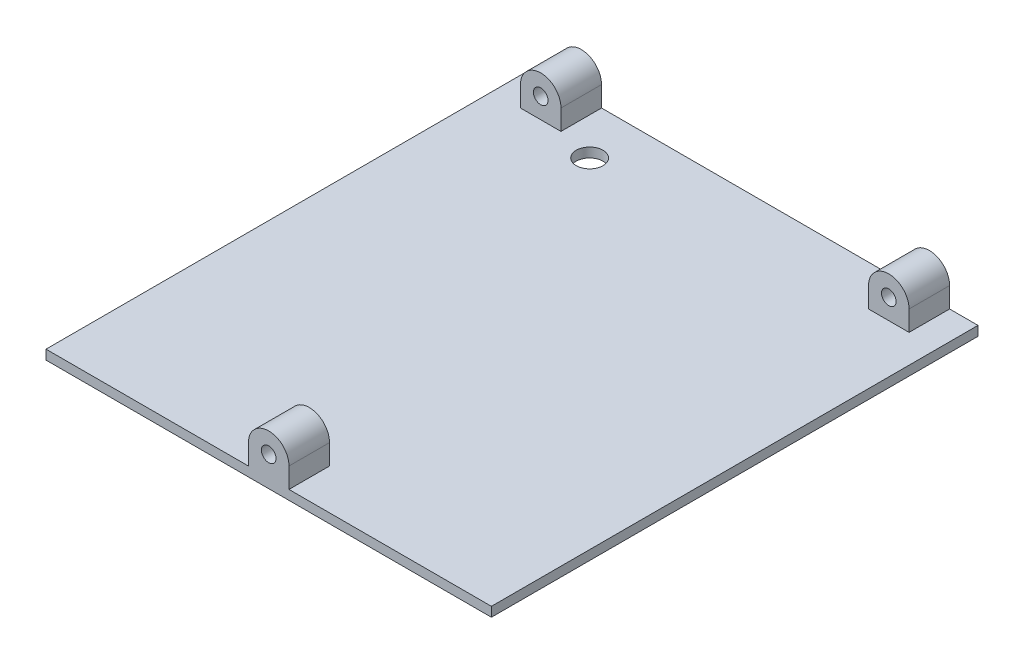
ISO-10303-21;
HEADER;
FILE_DESCRIPTION(('STEP AP214'),'2;1');
FILE_NAME('part.step','',(''),(''),'','','');
FILE_SCHEMA(('AUTOMOTIVE_DESIGN { 1 0 10303 214 1 1 1 1 }'));
ENDSEC;
DATA;
#1=APPLICATION_CONTEXT('core data for automotive mechanical design processes');
#2=APPLICATION_PROTOCOL_DEFINITION('international standard','automotive_design',2000,#1);
#3=PRODUCT_CONTEXT('',#1,'mechanical');
#4=PRODUCT('Part','Part','',(#3));
#5=PRODUCT_RELATED_PRODUCT_CATEGORY('part','',(#4));
#6=PRODUCT_DEFINITION_FORMATION('','',#4);
#7=PRODUCT_DEFINITION_CONTEXT('part definition',#1,'design');
#8=PRODUCT_DEFINITION('design','',#6,#7);
#9=PRODUCT_DEFINITION_SHAPE('','',#8);
#10=(LENGTH_UNIT() NAMED_UNIT(*) SI_UNIT(.MILLI.,.METRE.));
#11=(NAMED_UNIT(*) PLANE_ANGLE_UNIT() SI_UNIT($,.RADIAN.));
#12=(NAMED_UNIT(*) SI_UNIT($,.STERADIAN.) SOLID_ANGLE_UNIT());
#13=UNCERTAINTY_MEASURE_WITH_UNIT(LENGTH_MEASURE(1.E-05),#10,'distance_accuracy_value','');
#14=(GEOMETRIC_REPRESENTATION_CONTEXT(3) GLOBAL_UNCERTAINTY_ASSIGNED_CONTEXT((#13)) GLOBAL_UNIT_ASSIGNED_CONTEXT((#10,
#11,#12)) REPRESENTATION_CONTEXT('',''));
#15=CARTESIAN_POINT('',(0.,0.,0.));
#16=DIRECTION('',(0.,0.,1.));
#17=DIRECTION('',(1.,0.,0.));
#18=AXIS2_PLACEMENT_3D('',#15,#16,#17);
#19=CARTESIAN_POINT('',(0.,6.35,0.));
#20=DIRECTION('',(1.,0.,0.));
#21=DIRECTION('',(0.,0.,-1.));
#22=AXIS2_PLACEMENT_3D('',#19,#20,#21);
#23=PLANE('',#22);
#24=DIRECTION('',(0.,0.,1.));
#25=VECTOR('',#24,1.);
#26=CARTESIAN_POINT('',(0.,2.975,-152.4));
#27=LINE('',#26,#25);
#28=CARTESIAN_POINT('',(0.,2.975,-152.4));
#29=VERTEX_POINT('',#28);
#30=CARTESIAN_POINT('',(0.,2.975,0.));
#31=VERTEX_POINT('',#30);
#32=EDGE_CURVE('E290',#29,#31,#27,.T.);
#33=ORIENTED_EDGE('',*,*,#32,.F.);
#34=DIRECTION('',(0.,-1.,0.));
#35=VECTOR('',#34,1.);
#36=CARTESIAN_POINT('',(0.,6.35,-152.4));
#37=LINE('',#36,#35);
#38=CARTESIAN_POINT('',(0.,0.,-152.4));
#39=VERTEX_POINT('',#38);
#40=EDGE_CURVE('E331',#29,#39,#37,.T.);
#41=ORIENTED_EDGE('',*,*,#40,.T.);
#42=DIRECTION('',(0.,0.,1.));
#43=VECTOR('',#42,1.);
#44=CARTESIAN_POINT('',(0.,0.,0.));
#45=LINE('',#44,#43);
#46=CARTESIAN_POINT('',(0.,0.,0.));
#47=VERTEX_POINT('',#46);
#48=EDGE_CURVE('E314',#39,#47,#45,.T.);
#49=ORIENTED_EDGE('',*,*,#48,.T.);
#50=DIRECTION('',(0.,-1.,0.));
#51=VECTOR('',#50,1.);
#52=CARTESIAN_POINT('',(0.,6.35,0.));
#53=LINE('',#52,#51);
#54=EDGE_CURVE('E11',#31,#47,#53,.T.);
#55=ORIENTED_EDGE('',*,*,#54,.F.);
#56=EDGE_LOOP('',(#33,#41,#49,#55));
#57=FACE_BOUND('',#56,.T.);
#58=ADVANCED_FACE('F39',(#57),#23,.F.);
#59=CARTESIAN_POINT('',(0.,6.35,0.));
#60=DIRECTION('',(0.,0.,-1.));
#61=DIRECTION('',(-1.,0.,0.));
#62=AXIS2_PLACEMENT_3D('',#59,#60,#61);
#63=PLANE('',#62);
#64=DIRECTION('',(1.,0.,0.));
#65=VECTOR('',#64,1.);
#66=CARTESIAN_POINT('',(0.,2.975,0.));
#67=LINE('',#66,#65);
#68=CARTESIAN_POINT('',(63.4,2.975,0.));
#69=VERTEX_POINT('',#68);
#70=EDGE_CURVE('E303',#31,#69,#67,.T.);
#71=ORIENTED_EDGE('',*,*,#70,.F.);
#72=ORIENTED_EDGE('',*,*,#54,.T.);
#73=DIRECTION('',(1.,0.,0.));
#74=VECTOR('',#73,1.);
#75=CARTESIAN_POINT('',(0.,0.,0.));
#76=LINE('',#75,#74);
#77=CARTESIAN_POINT('',(139.5,0.,0.));
#78=VERTEX_POINT('',#77);
#79=EDGE_CURVE('E319',#47,#78,#76,.T.);
#80=ORIENTED_EDGE('',*,*,#79,.T.);
#81=DIRECTION('',(0.,-1.,0.));
#82=VECTOR('',#81,1.);
#83=CARTESIAN_POINT('',(139.5,6.35,0.));
#84=LINE('',#83,#82);
#85=CARTESIAN_POINT('',(139.5,2.975,0.));
#86=VERTEX_POINT('',#85);
#87=EDGE_CURVE('E48',#86,#78,#84,.T.);
#88=ORIENTED_EDGE('',*,*,#87,.F.);
#89=CARTESIAN_POINT('',(76.1,2.975,0.));
#90=VERTEX_POINT('',#89);
#91=EDGE_CURVE('E302',#90,#86,#67,.T.);
#92=ORIENTED_EDGE('',*,*,#91,.F.);
#93=DIRECTION('',(0.,1.,0.));
#94=VECTOR('',#93,1.);
#95=CARTESIAN_POINT('',(76.1,9.32500015835304,0.));
#96=LINE('',#95,#94);
#97=CARTESIAN_POINT('',(76.1,9.32500015835304,0.));
#98=VERTEX_POINT('',#97);
#99=EDGE_CURVE('E264',#90,#98,#96,.T.);
#100=ORIENTED_EDGE('',*,*,#99,.T.);
#101=CARTESIAN_POINT('',(69.75,9.32500015835304,0.));
#102=DIRECTION('',(0.,0.,1.));
#103=DIRECTION('',(1.,0.,0.));
#104=AXIS2_PLACEMENT_3D('',#101,#102,#103);
#105=CIRCLE('',#104,6.35);
#106=CARTESIAN_POINT('',(63.4,9.325,0.));
#107=VERTEX_POINT('',#106);
#108=EDGE_CURVE('E255',#98,#107,#105,.T.);
#109=ORIENTED_EDGE('',*,*,#108,.T.);
#110=DIRECTION('',(0.,-1.,0.));
#111=VECTOR('',#110,1.);
#112=CARTESIAN_POINT('',(63.4,9.325,0.));
#113=LINE('',#112,#111);
#114=EDGE_CURVE('E280',#107,#69,#113,.T.);
#115=ORIENTED_EDGE('',*,*,#114,.T.);
#116=EDGE_LOOP('',(#71,#72,#80,#88,#92,#100,#109,#115));
#117=FACE_BOUND('',#116,.T.);
#118=CARTESIAN_POINT('',(69.75,9.32500015835304,0.));
#119=DIRECTION('',(0.,0.,1.));
#120=DIRECTION('',(1.,0.,0.));
#121=AXIS2_PLACEMENT_3D('',#118,#119,#120);
#122=CIRCLE('',#121,2.28599999999999);
#123=CARTESIAN_POINT('',(72.036,9.32500015835304,0.));
#124=VERTEX_POINT('',#123);
#125=EDGE_CURVE('E240',#124,#124,#122,.T.);
#126=ORIENTED_EDGE('',*,*,#125,.F.);
#127=EDGE_LOOP('',(#126));
#128=FACE_BOUND('',#127,.T.);
#129=ADVANCED_FACE('F349',(#117,#128),#63,.F.);
#130=CARTESIAN_POINT('',(139.5,6.35,0.));
#131=DIRECTION('',(-1.,0.,0.));
#132=DIRECTION('',(0.,0.,1.));
#133=AXIS2_PLACEMENT_3D('',#130,#131,#132);
#134=PLANE('',#133);
#135=DIRECTION('',(0.,0.,-1.));
#136=VECTOR('',#135,1.);
#137=CARTESIAN_POINT('',(139.5,2.975,-152.4));
#138=LINE('',#137,#136);
#139=CARTESIAN_POINT('',(139.5,2.975,-152.4));
#140=VERTEX_POINT('',#139);
#141=EDGE_CURVE('E307',#86,#140,#138,.T.);
#142=ORIENTED_EDGE('',*,*,#141,.F.);
#143=ORIENTED_EDGE('',*,*,#87,.T.);
#144=DIRECTION('',(0.,0.,-1.));
#145=VECTOR('',#144,1.);
#146=CARTESIAN_POINT('',(139.5,0.,0.));
#147=LINE('',#146,#145);
#148=CARTESIAN_POINT('',(139.5,0.,-152.4));
#149=VERTEX_POINT('',#148);
#150=EDGE_CURVE('E323',#78,#149,#147,.T.);
#151=ORIENTED_EDGE('',*,*,#150,.T.);
#152=DIRECTION('',(0.,-1.,0.));
#153=VECTOR('',#152,1.);
#154=CARTESIAN_POINT('',(139.5,6.35,-152.4));
#155=LINE('',#154,#153);
#156=EDGE_CURVE('E334',#140,#149,#155,.T.);
#157=ORIENTED_EDGE('',*,*,#156,.F.);
#158=EDGE_LOOP('',(#142,#143,#151,#157));
#159=FACE_BOUND('',#158,.T.);
#160=ADVANCED_FACE('F341',(#159),#134,.F.);
#161=CARTESIAN_POINT('',(0.,6.35,-152.4));
#162=DIRECTION('',(0.,0.,1.));
#163=DIRECTION('',(1.,0.,0.));
#164=AXIS2_PLACEMENT_3D('',#161,#162,#163);
#165=PLANE('',#164);
#166=DIRECTION('',(-1.,0.,0.));
#167=VECTOR('',#166,1.);
#168=CARTESIAN_POINT('',(0.,2.975,-152.4));
#169=LINE('',#168,#167);
#170=CARTESIAN_POINT('',(130.61,2.975,-152.4));
#171=VERTEX_POINT('',#170);
#172=EDGE_CURVE('E311',#140,#171,#169,.T.);
#173=ORIENTED_EDGE('',*,*,#172,.F.);
#174=ORIENTED_EDGE('',*,*,#156,.T.);
#175=DIRECTION('',(-1.,0.,0.));
#176=VECTOR('',#175,1.);
#177=CARTESIAN_POINT('',(0.,0.,-152.4));
#178=LINE('',#177,#176);
#179=EDGE_CURVE('E327',#149,#39,#178,.T.);
#180=ORIENTED_EDGE('',*,*,#179,.T.);
#181=ORIENTED_EDGE('',*,*,#40,.F.);
#182=CARTESIAN_POINT('',(8.89,2.975,-152.4));
#183=VERTEX_POINT('',#182);
#184=EDGE_CURVE('E310',#183,#29,#169,.T.);
#185=ORIENTED_EDGE('',*,*,#184,.F.);
#186=DIRECTION('',(0.,1.,0.));
#187=VECTOR('',#186,1.);
#188=CARTESIAN_POINT('',(8.89,9.325,-152.4));
#189=LINE('',#188,#187);
#190=CARTESIAN_POINT('',(8.89,9.325,-152.4));
#191=VERTEX_POINT('',#190);
#192=EDGE_CURVE('E175',#183,#191,#189,.T.);
#193=ORIENTED_EDGE('',*,*,#192,.T.);
#194=CARTESIAN_POINT('',(15.24,9.325,-152.4));
#195=DIRECTION('',(0.,0.,-1.));
#196=DIRECTION('',(-1.,0.,0.));
#197=AXIS2_PLACEMENT_3D('',#194,#195,#196);
#198=CIRCLE('',#197,6.35);
#199=CARTESIAN_POINT('',(21.59,9.325,-152.4));
#200=VERTEX_POINT('',#199);
#201=EDGE_CURVE('E188',#191,#200,#198,.T.);
#202=ORIENTED_EDGE('',*,*,#201,.T.);
#203=DIRECTION('',(0.,-1.,0.));
#204=VECTOR('',#203,1.);
#205=CARTESIAN_POINT('',(21.59,9.325,-152.4));
#206=LINE('',#205,#204);
#207=CARTESIAN_POINT('',(21.59,2.975,-152.4));
#208=VERTEX_POINT('',#207);
#209=EDGE_CURVE('E156',#200,#208,#206,.T.);
#210=ORIENTED_EDGE('',*,*,#209,.T.);
#211=CARTESIAN_POINT('',(117.91,2.975,-152.4));
#212=VERTEX_POINT('',#211);
#213=EDGE_CURVE('E315',#212,#208,#169,.T.);
#214=ORIENTED_EDGE('',*,*,#213,.F.);
#215=DIRECTION('',(0.,1.,0.));
#216=VECTOR('',#215,1.);
#217=CARTESIAN_POINT('',(117.91,9.325,-152.4));
#218=LINE('',#217,#216);
#219=CARTESIAN_POINT('',(117.91,9.325,-152.4));
#220=VERTEX_POINT('',#219);
#221=EDGE_CURVE('E215',#212,#220,#218,.T.);
#222=ORIENTED_EDGE('',*,*,#221,.T.);
#223=CARTESIAN_POINT('',(124.26,9.325,-152.4));
#224=DIRECTION('',(0.,0.,-1.));
#225=DIRECTION('',(-1.,0.,0.));
#226=AXIS2_PLACEMENT_3D('',#223,#224,#225);
#227=CIRCLE('',#226,6.35);
#228=CARTESIAN_POINT('',(130.61,9.325,-152.4));
#229=VERTEX_POINT('',#228);
#230=EDGE_CURVE('E206',#220,#229,#227,.T.);
#231=ORIENTED_EDGE('',*,*,#230,.T.);
#232=DIRECTION('',(0.,-1.,0.));
#233=VECTOR('',#232,1.);
#234=CARTESIAN_POINT('',(130.61,9.325,-152.4));
#235=LINE('',#234,#233);
#236=EDGE_CURVE('E230',#229,#171,#235,.T.);
#237=ORIENTED_EDGE('',*,*,#236,.T.);
#238=EDGE_LOOP('',(#173,#174,#180,#181,#185,#193,#202,#210,#214,#222,#231,#237));
#239=FACE_BOUND('',#238,.T.);
#240=CARTESIAN_POINT('',(124.26,9.325,-152.4));
#241=DIRECTION('',(0.,0.,-1.));
#242=DIRECTION('',(-1.,0.,0.));
#243=AXIS2_PLACEMENT_3D('',#240,#241,#242);
#244=CIRCLE('',#243,2.28599999999999);
#245=CARTESIAN_POINT('',(121.974,9.325,-152.4));
#246=VERTEX_POINT('',#245);
#247=EDGE_CURVE('E196',#246,#246,#244,.T.);
#248=ORIENTED_EDGE('',*,*,#247,.F.);
#249=EDGE_LOOP('',(#248));
#250=FACE_BOUND('',#249,.T.);
#251=CARTESIAN_POINT('',(15.24,9.325,-152.4));
#252=DIRECTION('',(0.,0.,-1.));
#253=DIRECTION('',(-1.,0.,0.));
#254=AXIS2_PLACEMENT_3D('',#251,#252,#253);
#255=CIRCLE('',#254,2.286);
#256=CARTESIAN_POINT('',(12.954,9.325,-152.4));
#257=VERTEX_POINT('',#256);
#258=EDGE_CURVE('E181',#257,#257,#255,.T.);
#259=ORIENTED_EDGE('',*,*,#258,.F.);
#260=EDGE_LOOP('',(#259));
#261=FACE_BOUND('',#260,.T.);
#262=ADVANCED_FACE('F358',(#239,#250,#261),#165,.F.);
#263=CARTESIAN_POINT('',(0.,0.,0.));
#264=DIRECTION('',(0.,-1.,0.));
#265=DIRECTION('',(0.,0.,-1.));
#266=AXIS2_PLACEMENT_3D('',#263,#264,#265);
#267=PLANE('',#266);
#268=CARTESIAN_POINT('',(33.274,0.,-136.991598));
#269=DIRECTION('',(0.,-1.,0.));
#270=DIRECTION('',(0.,0.,-1.));
#271=AXIS2_PLACEMENT_3D('',#268,#269,#270);
#272=CIRCLE('',#271,4.191);
#273=CARTESIAN_POINT('',(33.274,0.,-141.182598));
#274=VERTEX_POINT('',#273);
#275=EDGE_CURVE('E457',#274,#274,#272,.T.);
#276=ORIENTED_EDGE('',*,*,#275,.F.);
#277=EDGE_LOOP('',(#276));
#278=FACE_BOUND('',#277,.T.);
#279=ORIENTED_EDGE('',*,*,#48,.F.);
#280=ORIENTED_EDGE('',*,*,#179,.F.);
#281=ORIENTED_EDGE('',*,*,#150,.F.);
#282=ORIENTED_EDGE('',*,*,#79,.F.);
#283=EDGE_LOOP('',(#279,#280,#281,#282));
#284=FACE_BOUND('',#283,.T.);
#285=ADVANCED_FACE('F354',(#278,#284),#267,.T.);
#286=CARTESIAN_POINT('',(0.,2.975,0.));
#287=DIRECTION('',(0.,1.,0.));
#288=DIRECTION('',(0.,0.,1.));
#289=AXIS2_PLACEMENT_3D('',#286,#287,#288);
#290=PLANE('',#289);
#291=CARTESIAN_POINT('',(33.274,2.975,-136.991598));
#292=DIRECTION('',(0.,1.,0.));
#293=DIRECTION('',(0.,0.,1.));
#294=AXIS2_PLACEMENT_3D('',#291,#292,#293);
#295=CIRCLE('',#294,4.191);
#296=CARTESIAN_POINT('',(33.274,2.975,-132.800598));
#297=VERTEX_POINT('',#296);
#298=EDGE_CURVE('E42',#297,#297,#295,.T.);
#299=ORIENTED_EDGE('',*,*,#298,.F.);
#300=EDGE_LOOP('',(#299));
#301=FACE_BOUND('',#300,.T.);
#302=DIRECTION('',(0.,0.,-1.));
#303=VECTOR('',#302,1.);
#304=CARTESIAN_POINT('',(8.89,2.975,-139.7));
#305=LINE('',#304,#303);
#306=CARTESIAN_POINT('',(8.89,2.975,-139.7));
#307=VERTEX_POINT('',#306);
#308=EDGE_CURVE('E197',#307,#183,#305,.T.);
#309=ORIENTED_EDGE('',*,*,#308,.T.);
#310=ORIENTED_EDGE('',*,*,#184,.T.);
#311=ORIENTED_EDGE('',*,*,#32,.T.);
#312=ORIENTED_EDGE('',*,*,#70,.T.);
#313=DIRECTION('',(0.,0.,1.));
#314=VECTOR('',#313,1.);
#315=CARTESIAN_POINT('',(63.4,2.975,-12.7));
#316=LINE('',#315,#314);
#317=CARTESIAN_POINT('',(63.4,2.975,-12.7));
#318=VERTEX_POINT('',#317);
#319=EDGE_CURVE('E295',#318,#69,#316,.T.);
#320=ORIENTED_EDGE('',*,*,#319,.F.);
#321=DIRECTION('',(1.,0.,0.));
#322=VECTOR('',#321,1.);
#323=CARTESIAN_POINT('',(63.4,2.975,-12.7));
#324=LINE('',#323,#322);
#325=CARTESIAN_POINT('',(76.1,2.97500000000001,-12.7));
#326=VERTEX_POINT('',#325);
#327=EDGE_CURVE('E268',#318,#326,#324,.T.);
#328=ORIENTED_EDGE('',*,*,#327,.T.);
#329=DIRECTION('',(0.,0.,1.));
#330=VECTOR('',#329,1.);
#331=CARTESIAN_POINT('',(76.1,2.97500000000001,-12.7));
#332=LINE('',#331,#330);
#333=EDGE_CURVE('E291',#326,#90,#332,.T.);
#334=ORIENTED_EDGE('',*,*,#333,.T.);
#335=ORIENTED_EDGE('',*,*,#91,.T.);
#336=ORIENTED_EDGE('',*,*,#141,.T.);
#337=ORIENTED_EDGE('',*,*,#172,.T.);
#338=DIRECTION('',(0.,0.,-1.));
#339=VECTOR('',#338,1.);
#340=CARTESIAN_POINT('',(130.61,2.975,-139.7));
#341=LINE('',#340,#339);
#342=CARTESIAN_POINT('',(130.61,2.975,-139.7));
#343=VERTEX_POINT('',#342);
#344=EDGE_CURVE('E245',#343,#171,#341,.T.);
#345=ORIENTED_EDGE('',*,*,#344,.F.);
#346=DIRECTION('',(-1.,0.,0.));
#347=VECTOR('',#346,1.);
#348=CARTESIAN_POINT('',(130.61,2.975,-139.7));
#349=LINE('',#348,#347);
#350=CARTESIAN_POINT('',(117.91,2.975,-139.7));
#351=VERTEX_POINT('',#350);
#352=EDGE_CURVE('E219',#343,#351,#349,.T.);
#353=ORIENTED_EDGE('',*,*,#352,.T.);
#354=DIRECTION('',(0.,0.,-1.));
#355=VECTOR('',#354,1.);
#356=CARTESIAN_POINT('',(117.91,2.975,-139.7));
#357=LINE('',#356,#355);
#358=EDGE_CURVE('E241',#351,#212,#357,.T.);
#359=ORIENTED_EDGE('',*,*,#358,.T.);
#360=ORIENTED_EDGE('',*,*,#213,.T.);
#361=DIRECTION('',(0.,0.,-1.));
#362=VECTOR('',#361,1.);
#363=CARTESIAN_POINT('',(21.59,2.975,-139.7));
#364=LINE('',#363,#362);
#365=CARTESIAN_POINT('',(21.59,2.975,-139.7));
#366=VERTEX_POINT('',#365);
#367=EDGE_CURVE('E60',#366,#208,#364,.T.);
#368=ORIENTED_EDGE('',*,*,#367,.F.);
#369=DIRECTION('',(-1.,0.,0.));
#370=VECTOR('',#369,1.);
#371=CARTESIAN_POINT('',(21.59,2.975,-139.7));
#372=LINE('',#371,#370);
#373=EDGE_CURVE('E55',#366,#307,#372,.T.);
#374=ORIENTED_EDGE('',*,*,#373,.T.);
#375=EDGE_LOOP('',(#309,#310,#311,#312,#320,#328,#334,#335,#336,#337,#345,#353,#359,#360,#368,#374));
#376=FACE_BOUND('',#375,.T.);
#377=ADVANCED_FACE('F361',(#301,#376),#290,.T.);
#378=CARTESIAN_POINT('',(69.75,9.32500015835304,-12.7));
#379=DIRECTION('',(0.,0.,1.));
#380=DIRECTION('',(1.,0.,0.));
#381=AXIS2_PLACEMENT_3D('',#378,#379,#380);
#382=CYLINDRICAL_SURFACE('',#381,6.35);
#383=ORIENTED_EDGE('',*,*,#108,.F.);
#384=DIRECTION('',(0.,0.,1.));
#385=VECTOR('',#384,1.);
#386=CARTESIAN_POINT('',(76.1,9.32500015835304,-12.7));
#387=LINE('',#386,#385);
#388=CARTESIAN_POINT('',(76.1,9.32500015835304,-12.7));
#389=VERTEX_POINT('',#388);
#390=EDGE_CURVE('E287',#389,#98,#387,.T.);
#391=ORIENTED_EDGE('',*,*,#390,.F.);
#392=CARTESIAN_POINT('',(69.75,9.32500015835304,-12.7));
#393=DIRECTION('',(0.,0.,1.));
#394=DIRECTION('',(1.,0.,0.));
#395=AXIS2_PLACEMENT_3D('',#392,#393,#394);
#396=CIRCLE('',#395,6.35);
#397=CARTESIAN_POINT('',(63.4,9.325,-12.7));
#398=VERTEX_POINT('',#397);
#399=EDGE_CURVE('E259',#389,#398,#396,.T.);
#400=ORIENTED_EDGE('',*,*,#399,.T.);
#401=DIRECTION('',(0.,0.,1.));
#402=VECTOR('',#401,1.);
#403=CARTESIAN_POINT('',(63.4,9.325,-12.7));
#404=LINE('',#403,#402);
#405=EDGE_CURVE('E276',#398,#107,#404,.T.);
#406=ORIENTED_EDGE('',*,*,#405,.T.);
#407=EDGE_LOOP('',(#383,#391,#400,#406));
#408=FACE_BOUND('',#407,.T.);
#409=ADVANCED_FACE('F400',(#408),#382,.T.);
#410=CARTESIAN_POINT('',(76.1,9.32500015835304,-12.7));
#411=DIRECTION('',(1.,0.,0.));
#412=DIRECTION('',(0.,0.,-1.));
#413=AXIS2_PLACEMENT_3D('',#410,#411,#412);
#414=PLANE('',#413);
#415=ORIENTED_EDGE('',*,*,#99,.F.);
#416=ORIENTED_EDGE('',*,*,#333,.F.);
#417=DIRECTION('',(0.,1.,0.));
#418=VECTOR('',#417,1.);
#419=CARTESIAN_POINT('',(76.1,9.32500015835304,-12.7));
#420=LINE('',#419,#418);
#421=EDGE_CURVE('E272',#326,#389,#420,.T.);
#422=ORIENTED_EDGE('',*,*,#421,.T.);
#423=ORIENTED_EDGE('',*,*,#390,.T.);
#424=EDGE_LOOP('',(#415,#416,#422,#423));
#425=FACE_BOUND('',#424,.T.);
#426=ADVANCED_FACE('F404',(#425),#414,.T.);
#427=CARTESIAN_POINT('',(63.4,9.325,-12.7));
#428=DIRECTION('',(-1.,0.,0.));
#429=DIRECTION('',(0.,0.,1.));
#430=AXIS2_PLACEMENT_3D('',#427,#428,#429);
#431=PLANE('',#430);
#432=ORIENTED_EDGE('',*,*,#114,.F.);
#433=ORIENTED_EDGE('',*,*,#405,.F.);
#434=DIRECTION('',(0.,-1.,0.));
#435=VECTOR('',#434,1.);
#436=CARTESIAN_POINT('',(63.4,9.325,-12.7));
#437=LINE('',#436,#435);
#438=EDGE_CURVE('E263',#398,#318,#437,.T.);
#439=ORIENTED_EDGE('',*,*,#438,.T.);
#440=ORIENTED_EDGE('',*,*,#319,.T.);
#441=EDGE_LOOP('',(#432,#433,#439,#440));
#442=FACE_BOUND('',#441,.T.);
#443=ADVANCED_FACE('F406',(#442),#431,.T.);
#444=CARTESIAN_POINT('',(69.75,9.32500015835304,-12.7));
#445=DIRECTION('',(0.,0.,1.));
#446=DIRECTION('',(1.,0.,0.));
#447=AXIS2_PLACEMENT_3D('',#444,#445,#446);
#448=PLANE('',#447);
#449=CARTESIAN_POINT('',(69.75,9.32500015835304,-12.7));
#450=DIRECTION('',(0.,0.,1.));
#451=DIRECTION('',(1.,0.,0.));
#452=AXIS2_PLACEMENT_3D('',#449,#450,#451);
#453=CIRCLE('',#452,2.28599999999999);
#454=CARTESIAN_POINT('',(72.036,9.32500015835304,-12.7));
#455=VERTEX_POINT('',#454);
#456=EDGE_CURVE('E251',#455,#455,#453,.T.);
#457=ORIENTED_EDGE('',*,*,#456,.T.);
#458=EDGE_LOOP('',(#457));
#459=FACE_BOUND('',#458,.T.);
#460=ORIENTED_EDGE('',*,*,#399,.F.);
#461=ORIENTED_EDGE('',*,*,#421,.F.);
#462=ORIENTED_EDGE('',*,*,#327,.F.);
#463=ORIENTED_EDGE('',*,*,#438,.F.);
#464=EDGE_LOOP('',(#460,#461,#462,#463));
#465=FACE_BOUND('',#464,.T.);
#466=ADVANCED_FACE('F409',(#459,#465),#448,.F.);
#467=CARTESIAN_POINT('',(69.75,9.32500015835304,-12.7));
#468=DIRECTION('',(0.,0.,1.));
#469=DIRECTION('',(1.,0.,0.));
#470=AXIS2_PLACEMENT_3D('',#467,#468,#469);
#471=CYLINDRICAL_SURFACE('',#470,2.28599999999999);
#472=ORIENTED_EDGE('',*,*,#456,.F.);
#473=EDGE_LOOP('',(#472));
#474=FACE_BOUND('',#473,.T.);
#475=ORIENTED_EDGE('',*,*,#125,.T.);
#476=EDGE_LOOP('',(#475));
#477=FACE_BOUND('',#476,.T.);
#478=ADVANCED_FACE('F416',(#474,#477),#471,.F.);
#479=CARTESIAN_POINT('',(124.26,9.325,-139.7));
#480=DIRECTION('',(0.,0.,-1.));
#481=DIRECTION('',(-1.,0.,0.));
#482=AXIS2_PLACEMENT_3D('',#479,#480,#481);
#483=CYLINDRICAL_SURFACE('',#482,6.35);
#484=ORIENTED_EDGE('',*,*,#230,.F.);
#485=DIRECTION('',(0.,0.,-1.));
#486=VECTOR('',#485,1.);
#487=CARTESIAN_POINT('',(117.91,9.325,-139.7));
#488=LINE('',#487,#486);
#489=CARTESIAN_POINT('',(117.91,9.325,-139.7));
#490=VERTEX_POINT('',#489);
#491=EDGE_CURVE('E237',#490,#220,#488,.T.);
#492=ORIENTED_EDGE('',*,*,#491,.F.);
#493=CARTESIAN_POINT('',(124.26,9.325,-139.7));
#494=DIRECTION('',(0.,0.,-1.));
#495=DIRECTION('',(-1.,0.,0.));
#496=AXIS2_PLACEMENT_3D('',#493,#494,#495);
#497=CIRCLE('',#496,6.35);
#498=CARTESIAN_POINT('',(130.61,9.325,-139.7));
#499=VERTEX_POINT('',#498);
#500=EDGE_CURVE('E210',#490,#499,#497,.T.);
#501=ORIENTED_EDGE('',*,*,#500,.T.);
#502=DIRECTION('',(0.,0.,-1.));
#503=VECTOR('',#502,1.);
#504=CARTESIAN_POINT('',(130.61,9.325,-139.7));
#505=LINE('',#504,#503);
#506=EDGE_CURVE('E226',#499,#229,#505,.T.);
#507=ORIENTED_EDGE('',*,*,#506,.T.);
#508=EDGE_LOOP('',(#484,#492,#501,#507));
#509=FACE_BOUND('',#508,.T.);
#510=ADVANCED_FACE('F372',(#509),#483,.T.);
#511=CARTESIAN_POINT('',(117.91,9.325,-139.7));
#512=DIRECTION('',(-1.,0.,0.));
#513=DIRECTION('',(0.,0.,1.));
#514=AXIS2_PLACEMENT_3D('',#511,#512,#513);
#515=PLANE('',#514);
#516=ORIENTED_EDGE('',*,*,#221,.F.);
#517=ORIENTED_EDGE('',*,*,#358,.F.);
#518=DIRECTION('',(0.,1.,0.));
#519=VECTOR('',#518,1.);
#520=CARTESIAN_POINT('',(117.91,9.325,-139.7));
#521=LINE('',#520,#519);
#522=EDGE_CURVE('E222',#351,#490,#521,.T.);
#523=ORIENTED_EDGE('',*,*,#522,.T.);
#524=ORIENTED_EDGE('',*,*,#491,.T.);
#525=EDGE_LOOP('',(#516,#517,#523,#524));
#526=FACE_BOUND('',#525,.T.);
#527=ADVANCED_FACE('F375',(#526),#515,.T.);
#528=CARTESIAN_POINT('',(130.61,9.325,-139.7));
#529=DIRECTION('',(1.,0.,0.));
#530=DIRECTION('',(0.,0.,-1.));
#531=AXIS2_PLACEMENT_3D('',#528,#529,#530);
#532=PLANE('',#531);
#533=ORIENTED_EDGE('',*,*,#236,.F.);
#534=ORIENTED_EDGE('',*,*,#506,.F.);
#535=DIRECTION('',(0.,-1.,0.));
#536=VECTOR('',#535,1.);
#537=CARTESIAN_POINT('',(130.61,9.325,-139.7));
#538=LINE('',#537,#536);
#539=EDGE_CURVE('E214',#499,#343,#538,.T.);
#540=ORIENTED_EDGE('',*,*,#539,.T.);
#541=ORIENTED_EDGE('',*,*,#344,.T.);
#542=EDGE_LOOP('',(#533,#534,#540,#541));
#543=FACE_BOUND('',#542,.T.);
#544=ADVANCED_FACE('F364',(#543),#532,.T.);
#545=CARTESIAN_POINT('',(124.26,9.325,-139.7));
#546=DIRECTION('',(0.,0.,-1.));
#547=DIRECTION('',(-1.,0.,0.));
#548=AXIS2_PLACEMENT_3D('',#545,#546,#547);
#549=PLANE('',#548);
#550=CARTESIAN_POINT('',(124.26,9.325,-139.7));
#551=DIRECTION('',(0.,0.,-1.));
#552=DIRECTION('',(-1.,0.,0.));
#553=AXIS2_PLACEMENT_3D('',#550,#551,#552);
#554=CIRCLE('',#553,2.28599999999999);
#555=CARTESIAN_POINT('',(121.974,9.325,-139.7));
#556=VERTEX_POINT('',#555);
#557=EDGE_CURVE('E202',#556,#556,#554,.T.);
#558=ORIENTED_EDGE('',*,*,#557,.T.);
#559=EDGE_LOOP('',(#558));
#560=FACE_BOUND('',#559,.T.);
#561=ORIENTED_EDGE('',*,*,#500,.F.);
#562=ORIENTED_EDGE('',*,*,#522,.F.);
#563=ORIENTED_EDGE('',*,*,#352,.F.);
#564=ORIENTED_EDGE('',*,*,#539,.F.);
#565=EDGE_LOOP('',(#561,#562,#563,#564));
#566=FACE_BOUND('',#565,.T.);
#567=ADVANCED_FACE('F368',(#560,#566),#549,.F.);
#568=CARTESIAN_POINT('',(124.26,9.325,-139.7));
#569=DIRECTION('',(0.,0.,-1.));
#570=DIRECTION('',(-1.,0.,0.));
#571=AXIS2_PLACEMENT_3D('',#568,#569,#570);
#572=CYLINDRICAL_SURFACE('',#571,2.28599999999999);
#573=ORIENTED_EDGE('',*,*,#557,.F.);
#574=EDGE_LOOP('',(#573));
#575=FACE_BOUND('',#574,.T.);
#576=ORIENTED_EDGE('',*,*,#247,.T.);
#577=EDGE_LOOP('',(#576));
#578=FACE_BOUND('',#577,.T.);
#579=ADVANCED_FACE('F429',(#575,#578),#572,.F.);
#580=CARTESIAN_POINT('',(15.24,9.325,-139.7));
#581=DIRECTION('',(0.,0.,-1.));
#582=DIRECTION('',(-1.,0.,0.));
#583=AXIS2_PLACEMENT_3D('',#580,#581,#582);
#584=CYLINDRICAL_SURFACE('',#583,6.35);
#585=ORIENTED_EDGE('',*,*,#201,.F.);
#586=DIRECTION('',(0.,0.,-1.));
#587=VECTOR('',#586,1.);
#588=CARTESIAN_POINT('',(8.89,9.325,-139.7));
#589=LINE('',#588,#587);
#590=CARTESIAN_POINT('',(8.89,9.325,-139.7));
#591=VERTEX_POINT('',#590);
#592=EDGE_CURVE('E173',#591,#191,#589,.T.);
#593=ORIENTED_EDGE('',*,*,#592,.F.);
#594=CARTESIAN_POINT('',(15.24,9.325,-139.7));
#595=DIRECTION('',(0.,0.,-1.));
#596=DIRECTION('',(-1.,0.,0.));
#597=AXIS2_PLACEMENT_3D('',#594,#595,#596);
#598=CIRCLE('',#597,6.35);
#599=CARTESIAN_POINT('',(21.59,9.325,-139.7));
#600=VERTEX_POINT('',#599);
#601=EDGE_CURVE('E168',#591,#600,#598,.T.);
#602=ORIENTED_EDGE('',*,*,#601,.T.);
#603=DIRECTION('',(0.,0.,-1.));
#604=VECTOR('',#603,1.);
#605=CARTESIAN_POINT('',(21.59,9.325,-139.7));
#606=LINE('',#605,#604);
#607=EDGE_CURVE('E151',#600,#200,#606,.T.);
#608=ORIENTED_EDGE('',*,*,#607,.T.);
#609=EDGE_LOOP('',(#585,#593,#602,#608));
#610=FACE_BOUND('',#609,.T.);
#611=ADVANCED_FACE('F172',(#610),#584,.T.);
#612=CARTESIAN_POINT('',(8.89,9.325,-139.7));
#613=DIRECTION('',(-1.,0.,0.));
#614=DIRECTION('',(0.,-1.,0.));
#615=AXIS2_PLACEMENT_3D('',#612,#613,#614);
#616=PLANE('',#615);
#617=ORIENTED_EDGE('',*,*,#192,.F.);
#618=ORIENTED_EDGE('',*,*,#308,.F.);
#619=DIRECTION('',(0.,1.,0.));
#620=VECTOR('',#619,1.);
#621=CARTESIAN_POINT('',(8.89,9.325,-139.7));
#622=LINE('',#621,#620);
#623=EDGE_CURVE('E162',#307,#591,#622,.T.);
#624=ORIENTED_EDGE('',*,*,#623,.T.);
#625=ORIENTED_EDGE('',*,*,#592,.T.);
#626=EDGE_LOOP('',(#617,#618,#624,#625));
#627=FACE_BOUND('',#626,.T.);
#628=ADVANCED_FACE('F380',(#627),#616,.T.);
#629=CARTESIAN_POINT('',(21.59,9.325,-139.7));
#630=DIRECTION('',(1.,0.,0.));
#631=DIRECTION('',(0.,1.,0.));
#632=AXIS2_PLACEMENT_3D('',#629,#630,#631);
#633=PLANE('',#632);
#634=ORIENTED_EDGE('',*,*,#209,.F.);
#635=ORIENTED_EDGE('',*,*,#607,.F.);
#636=DIRECTION('',(0.,-1.,0.));
#637=VECTOR('',#636,1.);
#638=CARTESIAN_POINT('',(21.59,9.325,-139.7));
#639=LINE('',#638,#637);
#640=EDGE_CURVE('E154',#600,#366,#639,.T.);
#641=ORIENTED_EDGE('',*,*,#640,.T.);
#642=ORIENTED_EDGE('',*,*,#367,.T.);
#643=EDGE_LOOP('',(#634,#635,#641,#642));
#644=FACE_BOUND('',#643,.T.);
#645=ADVANCED_FACE('F153',(#644),#633,.T.);
#646=CARTESIAN_POINT('',(15.24,9.325,-139.7));
#647=DIRECTION('',(0.,0.,-1.));
#648=DIRECTION('',(-1.,0.,0.));
#649=AXIS2_PLACEMENT_3D('',#646,#647,#648);
#650=PLANE('',#649);
#651=CARTESIAN_POINT('',(15.24,9.325,-139.7));
#652=DIRECTION('',(0.,0.,-1.));
#653=DIRECTION('',(-1.,0.,0.));
#654=AXIS2_PLACEMENT_3D('',#651,#652,#653);
#655=CIRCLE('',#654,2.286);
#656=CARTESIAN_POINT('',(12.954,9.325,-139.7));
#657=VERTEX_POINT('',#656);
#658=EDGE_CURVE('E191',#657,#657,#655,.T.);
#659=ORIENTED_EDGE('',*,*,#658,.T.);
#660=EDGE_LOOP('',(#659));
#661=FACE_BOUND('',#660,.T.);
#662=ORIENTED_EDGE('',*,*,#601,.F.);
#663=ORIENTED_EDGE('',*,*,#623,.F.);
#664=ORIENTED_EDGE('',*,*,#373,.F.);
#665=ORIENTED_EDGE('',*,*,#640,.F.);
#666=EDGE_LOOP('',(#662,#663,#664,#665));
#667=FACE_BOUND('',#666,.T.);
#668=ADVANCED_FACE('F166',(#661,#667),#650,.F.);
#669=CARTESIAN_POINT('',(15.24,9.325,-139.7));
#670=DIRECTION('',(0.,0.,-1.));
#671=DIRECTION('',(-1.,0.,0.));
#672=AXIS2_PLACEMENT_3D('',#669,#670,#671);
#673=CYLINDRICAL_SURFACE('',#672,2.286);
#674=ORIENTED_EDGE('',*,*,#658,.F.);
#675=EDGE_LOOP('',(#674));
#676=FACE_BOUND('',#675,.T.);
#677=ORIENTED_EDGE('',*,*,#258,.T.);
#678=EDGE_LOOP('',(#677));
#679=FACE_BOUND('',#678,.T.);
#680=ADVANCED_FACE('F442',(#676,#679),#673,.F.);
#681=CARTESIAN_POINT('',(33.274,15.675000158353,-136.991598));
#682=DIRECTION('',(0.,-1.,0.));
#683=DIRECTION('',(0.,0.,-1.));
#684=AXIS2_PLACEMENT_3D('',#681,#682,#683);
#685=CYLINDRICAL_SURFACE('',#684,4.191);
#686=ORIENTED_EDGE('',*,*,#298,.T.);
#687=EDGE_LOOP('',(#686));
#688=FACE_BOUND('',#687,.T.);
#689=ORIENTED_EDGE('',*,*,#275,.T.);
#690=EDGE_LOOP('',(#689));
#691=FACE_BOUND('',#690,.T.);
#692=ADVANCED_FACE('F446',(#688,#691),#685,.F.);
#693=CLOSED_SHELL('',(#58,#129,#160,#262,#285,#377,#409,#426,#443,#466,#478,#510,#527,#544,#567,
#579,#611,#628,#645,#668,#680,#692));
#694=MANIFOLD_SOLID_BREP('B2',#693);
#695=ADVANCED_BREP_SHAPE_REPRESENTATION('',(#18,#694),#14);
#696=SHAPE_DEFINITION_REPRESENTATION(#9,#695);
ENDSEC;
END-ISO-10303-21;
